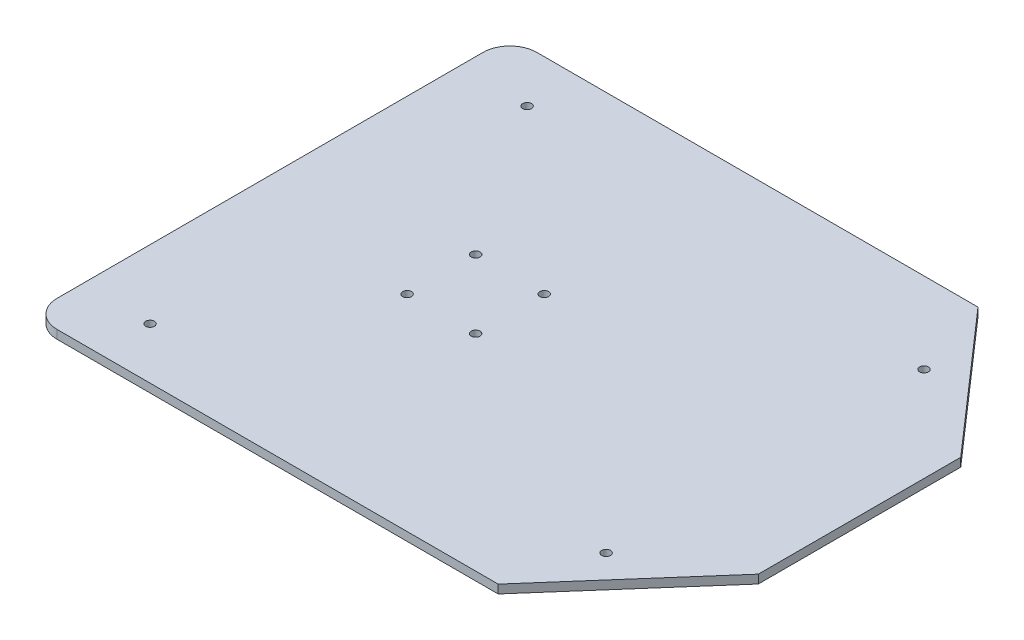
ISO-10303-21;
HEADER;
FILE_DESCRIPTION(('STEP AP214'),'2;1');
FILE_NAME('part.step','',(''),(''),'','','');
FILE_SCHEMA(('AUTOMOTIVE_DESIGN { 1 0 10303 214 1 1 1 1 }'));
ENDSEC;
DATA;
#1=APPLICATION_CONTEXT('core data for automotive mechanical design processes');
#2=APPLICATION_PROTOCOL_DEFINITION('international standard','automotive_design',2000,#1);
#3=PRODUCT_CONTEXT('',#1,'mechanical');
#4=PRODUCT('Part','Part','',(#3));
#5=PRODUCT_RELATED_PRODUCT_CATEGORY('part','',(#4));
#6=PRODUCT_DEFINITION_FORMATION('','',#4);
#7=PRODUCT_DEFINITION_CONTEXT('part definition',#1,'design');
#8=PRODUCT_DEFINITION('design','',#6,#7);
#9=PRODUCT_DEFINITION_SHAPE('','',#8);
#10=(LENGTH_UNIT() NAMED_UNIT(*) SI_UNIT(.MILLI.,.METRE.));
#11=(NAMED_UNIT(*) PLANE_ANGLE_UNIT() SI_UNIT($,.RADIAN.));
#12=(NAMED_UNIT(*) SI_UNIT($,.STERADIAN.) SOLID_ANGLE_UNIT());
#13=UNCERTAINTY_MEASURE_WITH_UNIT(LENGTH_MEASURE(1.E-05),#10,'distance_accuracy_value','');
#14=(GEOMETRIC_REPRESENTATION_CONTEXT(3) GLOBAL_UNCERTAINTY_ASSIGNED_CONTEXT((#13)) GLOBAL_UNIT_ASSIGNED_CONTEXT((#10,
#11,#12)) REPRESENTATION_CONTEXT('',''));
#15=CARTESIAN_POINT('',(0.,0.,0.));
#16=DIRECTION('',(0.,0.,1.));
#17=DIRECTION('',(1.,0.,0.));
#18=AXIS2_PLACEMENT_3D('',#15,#16,#17);
#19=CARTESIAN_POINT('',(-66.2,3.175,78.9));
#20=DIRECTION('',(0.,1.,0.));
#21=DIRECTION('',(0.,0.,1.));
#22=AXIS2_PLACEMENT_3D('',#19,#20,#21);
#23=PLANE('',#22);
#24=CARTESIAN_POINT('',(107.24,3.175,58.9));
#25=DIRECTION('',(0.,1.,0.));
#26=DIRECTION('',(0.,0.,1.));
#27=AXIS2_PLACEMENT_3D('',#24,#25,#26);
#28=CIRCLE('',#27,1.63194999999999);
#29=CARTESIAN_POINT('',(107.24,3.175,60.53195));
#30=VERTEX_POINT('',#29);
#31=EDGE_CURVE('E212',#30,#30,#28,.T.);
#32=ORIENTED_EDGE('',*,*,#31,.F.);
#33=EDGE_LOOP('',(#32));
#34=FACE_BOUND('',#33,.T.);
#35=CARTESIAN_POINT('',(-50.8,3.175,-69.85));
#36=DIRECTION('',(0.,1.,0.));
#37=DIRECTION('',(0.,0.,1.));
#38=AXIS2_PLACEMENT_3D('',#35,#36,#37);
#39=CIRCLE('',#38,1.63195);
#40=CARTESIAN_POINT('',(-50.8,3.175,-68.21805));
#41=VERTEX_POINT('',#40);
#42=EDGE_CURVE('E200',#41,#41,#39,.T.);
#43=ORIENTED_EDGE('',*,*,#42,.F.);
#44=EDGE_LOOP('',(#43));
#45=FACE_BOUND('',#44,.T.);
#46=CARTESIAN_POINT('',(12.7,3.175,12.7));
#47=DIRECTION('',(0.,1.,0.));
#48=DIRECTION('',(0.,0.,1.));
#49=AXIS2_PLACEMENT_3D('',#46,#47,#48);
#50=CIRCLE('',#49,1.63195);
#51=CARTESIAN_POINT('',(12.7,3.175,14.33195));
#52=VERTEX_POINT('',#51);
#53=EDGE_CURVE('E188',#52,#52,#50,.T.);
#54=ORIENTED_EDGE('',*,*,#53,.F.);
#55=EDGE_LOOP('',(#54));
#56=FACE_BOUND('',#55,.T.);
#57=CARTESIAN_POINT('',(-12.7,3.175,-12.7));
#58=DIRECTION('',(0.,1.,0.));
#59=DIRECTION('',(0.,0.,1.));
#60=AXIS2_PLACEMENT_3D('',#57,#58,#59);
#61=CIRCLE('',#60,1.63195);
#62=CARTESIAN_POINT('',(-12.7,3.175,-11.06805));
#63=VERTEX_POINT('',#62);
#64=EDGE_CURVE('E134',#63,#63,#61,.T.);
#65=ORIENTED_EDGE('',*,*,#64,.F.);
#66=EDGE_LOOP('',(#65));
#67=FACE_BOUND('',#66,.T.);
#68=CARTESIAN_POINT('',(-66.2,3.175,78.9));
#69=DIRECTION('',(0.,1.,0.));
#70=DIRECTION('',(0.,0.,1.));
#71=AXIS2_PLACEMENT_3D('',#68,#69,#70);
#72=CIRCLE('',#71,9.99999999999999);
#73=CARTESIAN_POINT('',(-76.2,3.175,78.8999999999999));
#74=VERTEX_POINT('',#73);
#75=CARTESIAN_POINT('',(-66.1999999999999,3.175,88.9));
#76=VERTEX_POINT('',#75);
#77=EDGE_CURVE('E145',#74,#76,#72,.T.);
#78=ORIENTED_EDGE('',*,*,#77,.T.);
#79=DIRECTION('',(1.,0.,0.));
#80=VECTOR('',#79,1.);
#81=CARTESIAN_POINT('',(-66.1999999999999,3.175,88.9));
#82=LINE('',#81,#80);
#83=CARTESIAN_POINT('',(97.24,3.175,88.9));
#84=VERTEX_POINT('',#83);
#85=EDGE_CURVE('E93',#76,#84,#82,.T.);
#86=ORIENTED_EDGE('',*,*,#85,.T.);
#87=DIRECTION('',(0.658711847193232,0.,-0.752395309905159));
#88=VECTOR('',#87,1.);
#89=CARTESIAN_POINT('',(142.24,3.175,37.5));
#90=LINE('',#89,#88);
#91=CARTESIAN_POINT('',(142.24,3.175,37.5));
#92=VERTEX_POINT('',#91);
#93=EDGE_CURVE('E160',#84,#92,#90,.T.);
#94=ORIENTED_EDGE('',*,*,#93,.T.);
#95=DIRECTION('',(0.,0.,-1.));
#96=VECTOR('',#95,1.);
#97=CARTESIAN_POINT('',(142.24,3.175,-37.5));
#98=LINE('',#97,#96);
#99=CARTESIAN_POINT('',(142.24,3.175,-37.5));
#100=VERTEX_POINT('',#99);
#101=EDGE_CURVE('E173',#92,#100,#98,.T.);
#102=ORIENTED_EDGE('',*,*,#101,.T.);
#103=DIRECTION('',(-0.658711847193232,0.,-0.752395309905159));
#104=VECTOR('',#103,1.);
#105=CARTESIAN_POINT('',(97.24,3.175,-88.9));
#106=LINE('',#105,#104);
#107=CARTESIAN_POINT('',(97.24,3.175,-88.9));
#108=VERTEX_POINT('',#107);
#109=EDGE_CURVE('E112',#100,#108,#106,.T.);
#110=ORIENTED_EDGE('',*,*,#109,.T.);
#111=DIRECTION('',(-1.,0.,0.));
#112=VECTOR('',#111,1.);
#113=CARTESIAN_POINT('',(-66.2,3.175,-88.9));
#114=LINE('',#113,#112);
#115=CARTESIAN_POINT('',(-66.2,3.175,-88.9));
#116=VERTEX_POINT('',#115);
#117=EDGE_CURVE('E106',#108,#116,#114,.T.);
#118=ORIENTED_EDGE('',*,*,#117,.T.);
#119=CARTESIAN_POINT('',(-66.2,3.175,-78.9));
#120=DIRECTION('',(0.,1.,0.));
#121=DIRECTION('',(0.,0.,1.));
#122=AXIS2_PLACEMENT_3D('',#119,#120,#121);
#123=CIRCLE('',#122,9.99999999999999);
#124=CARTESIAN_POINT('',(-76.2,3.175,-78.8999999999999));
#125=VERTEX_POINT('',#124);
#126=EDGE_CURVE('E110',#116,#125,#123,.T.);
#127=ORIENTED_EDGE('',*,*,#126,.T.);
#128=DIRECTION('',(0.,0.,1.));
#129=VECTOR('',#128,1.);
#130=CARTESIAN_POINT('',(-76.2,3.175,-78.8999999999999));
#131=LINE('',#130,#129);
#132=EDGE_CURVE('E50',#125,#74,#131,.T.);
#133=ORIENTED_EDGE('',*,*,#132,.T.);
#134=EDGE_LOOP('',(#78,#86,#94,#102,#110,#118,#127,#133));
#135=FACE_BOUND('',#134,.T.);
#136=CARTESIAN_POINT('',(12.7,3.175,-12.7));
#137=DIRECTION('',(0.,1.,0.));
#138=DIRECTION('',(0.,0.,1.));
#139=AXIS2_PLACEMENT_3D('',#136,#137,#138);
#140=CIRCLE('',#139,1.63195);
#141=CARTESIAN_POINT('',(12.7,3.175,-11.06805));
#142=VERTEX_POINT('',#141);
#143=EDGE_CURVE('E182',#142,#142,#140,.T.);
#144=ORIENTED_EDGE('',*,*,#143,.F.);
#145=EDGE_LOOP('',(#144));
#146=FACE_BOUND('',#145,.T.);
#147=CARTESIAN_POINT('',(-12.7,3.175,12.7));
#148=DIRECTION('',(0.,1.,0.));
#149=DIRECTION('',(0.,0.,1.));
#150=AXIS2_PLACEMENT_3D('',#147,#148,#149);
#151=CIRCLE('',#150,1.63195);
#152=CARTESIAN_POINT('',(-12.7,3.175,14.33195));
#153=VERTEX_POINT('',#152);
#154=EDGE_CURVE('E194',#153,#153,#151,.T.);
#155=ORIENTED_EDGE('',*,*,#154,.F.);
#156=EDGE_LOOP('',(#155));
#157=FACE_BOUND('',#156,.T.);
#158=CARTESIAN_POINT('',(107.24,3.175,-58.9));
#159=DIRECTION('',(0.,1.,0.));
#160=DIRECTION('',(0.,0.,1.));
#161=AXIS2_PLACEMENT_3D('',#158,#159,#160);
#162=CIRCLE('',#161,1.63194999999999);
#163=CARTESIAN_POINT('',(107.24,3.175,-57.26805));
#164=VERTEX_POINT('',#163);
#165=EDGE_CURVE('E206',#164,#164,#162,.T.);
#166=ORIENTED_EDGE('',*,*,#165,.F.);
#167=EDGE_LOOP('',(#166));
#168=FACE_BOUND('',#167,.T.);
#169=CARTESIAN_POINT('',(-50.8,3.175,69.85));
#170=DIRECTION('',(0.,1.,0.));
#171=DIRECTION('',(0.,0.,1.));
#172=AXIS2_PLACEMENT_3D('',#169,#170,#171);
#173=CIRCLE('',#172,1.63195);
#174=CARTESIAN_POINT('',(-50.8,3.175,71.48195));
#175=VERTEX_POINT('',#174);
#176=EDGE_CURVE('E218',#175,#175,#173,.T.);
#177=ORIENTED_EDGE('',*,*,#176,.F.);
#178=EDGE_LOOP('',(#177));
#179=FACE_BOUND('',#178,.T.);
#180=ADVANCED_FACE('F33',(#34,#45,#56,#67,#135,#146,#157,#168,#179),#23,.T.);
#181=CARTESIAN_POINT('',(-66.2,0.,78.9));
#182=DIRECTION('',(0.,1.,0.));
#183=DIRECTION('',(0.,0.,1.));
#184=AXIS2_PLACEMENT_3D('',#181,#182,#183);
#185=PLANE('',#184);
#186=CARTESIAN_POINT('',(-66.2,0.,78.9));
#187=DIRECTION('',(0.,1.,0.));
#188=DIRECTION('',(0.,0.,1.));
#189=AXIS2_PLACEMENT_3D('',#186,#187,#188);
#190=CIRCLE('',#189,9.99999999999999);
#191=CARTESIAN_POINT('',(-76.2,0.,78.8999999999999));
#192=VERTEX_POINT('',#191);
#193=CARTESIAN_POINT('',(-66.1999999999999,0.,88.9));
#194=VERTEX_POINT('',#193);
#195=EDGE_CURVE('E130',#192,#194,#190,.T.);
#196=ORIENTED_EDGE('',*,*,#195,.F.);
#197=DIRECTION('',(0.,0.,1.));
#198=VECTOR('',#197,1.);
#199=CARTESIAN_POINT('',(-76.2,0.,-78.8999999999999));
#200=LINE('',#199,#198);
#201=CARTESIAN_POINT('',(-76.2,0.,-78.8999999999999));
#202=VERTEX_POINT('',#201);
#203=EDGE_CURVE('E85',#202,#192,#200,.T.);
#204=ORIENTED_EDGE('',*,*,#203,.F.);
#205=CARTESIAN_POINT('',(-66.2,0.,-78.9));
#206=DIRECTION('',(0.,1.,0.));
#207=DIRECTION('',(0.,0.,1.));
#208=AXIS2_PLACEMENT_3D('',#205,#206,#207);
#209=CIRCLE('',#208,9.99999999999999);
#210=CARTESIAN_POINT('',(-66.2,0.,-88.9));
#211=VERTEX_POINT('',#210);
#212=EDGE_CURVE('E79',#211,#202,#209,.T.);
#213=ORIENTED_EDGE('',*,*,#212,.F.);
#214=DIRECTION('',(-1.,0.,0.));
#215=VECTOR('',#214,1.);
#216=CARTESIAN_POINT('',(-66.2,0.,-88.9));
#217=LINE('',#216,#215);
#218=CARTESIAN_POINT('',(97.24,0.,-88.9));
#219=VERTEX_POINT('',#218);
#220=EDGE_CURVE('E120',#219,#211,#217,.T.);
#221=ORIENTED_EDGE('',*,*,#220,.F.);
#222=DIRECTION('',(-0.658711847193232,0.,-0.752395309905159));
#223=VECTOR('',#222,1.);
#224=CARTESIAN_POINT('',(97.24,0.,-88.9));
#225=LINE('',#224,#223);
#226=CARTESIAN_POINT('',(142.24,0.,-37.5));
#227=VERTEX_POINT('',#226);
#228=EDGE_CURVE('E140',#227,#219,#225,.T.);
#229=ORIENTED_EDGE('',*,*,#228,.F.);
#230=DIRECTION('',(0.,0.,-1.));
#231=VECTOR('',#230,1.);
#232=CARTESIAN_POINT('',(142.24,0.,-37.5));
#233=LINE('',#232,#231);
#234=CARTESIAN_POINT('',(142.24,0.,37.5));
#235=VERTEX_POINT('',#234);
#236=EDGE_CURVE('E138',#235,#227,#233,.T.);
#237=ORIENTED_EDGE('',*,*,#236,.F.);
#238=DIRECTION('',(0.658711847193232,0.,-0.752395309905159));
#239=VECTOR('',#238,1.);
#240=CARTESIAN_POINT('',(142.24,0.,37.5));
#241=LINE('',#240,#239);
#242=CARTESIAN_POINT('',(97.24,0.,88.9));
#243=VERTEX_POINT('',#242);
#244=EDGE_CURVE('E136',#243,#235,#241,.T.);
#245=ORIENTED_EDGE('',*,*,#244,.F.);
#246=DIRECTION('',(1.,0.,0.));
#247=VECTOR('',#246,1.);
#248=CARTESIAN_POINT('',(-66.1999999999999,0.,88.9));
#249=LINE('',#248,#247);
#250=EDGE_CURVE('E133',#194,#243,#249,.T.);
#251=ORIENTED_EDGE('',*,*,#250,.F.);
#252=EDGE_LOOP('',(#196,#204,#213,#221,#229,#237,#245,#251));
#253=FACE_BOUND('',#252,.T.);
#254=CARTESIAN_POINT('',(-12.7,0.,-12.7));
#255=DIRECTION('',(0.,1.,0.));
#256=DIRECTION('',(0.,0.,1.));
#257=AXIS2_PLACEMENT_3D('',#254,#255,#256);
#258=CIRCLE('',#257,1.63195);
#259=CARTESIAN_POINT('',(-12.7,0.,-11.06805));
#260=VERTEX_POINT('',#259);
#261=EDGE_CURVE('E179',#260,#260,#258,.T.);
#262=ORIENTED_EDGE('',*,*,#261,.T.);
#263=EDGE_LOOP('',(#262));
#264=FACE_BOUND('',#263,.T.);
#265=CARTESIAN_POINT('',(12.7,0.,-12.7));
#266=DIRECTION('',(0.,1.,0.));
#267=DIRECTION('',(0.,0.,1.));
#268=AXIS2_PLACEMENT_3D('',#265,#266,#267);
#269=CIRCLE('',#268,1.63195);
#270=CARTESIAN_POINT('',(12.7,0.,-11.06805));
#271=VERTEX_POINT('',#270);
#272=EDGE_CURVE('E185',#271,#271,#269,.T.);
#273=ORIENTED_EDGE('',*,*,#272,.T.);
#274=EDGE_LOOP('',(#273));
#275=FACE_BOUND('',#274,.T.);
#276=CARTESIAN_POINT('',(12.7,0.,12.7));
#277=DIRECTION('',(0.,1.,0.));
#278=DIRECTION('',(0.,0.,1.));
#279=AXIS2_PLACEMENT_3D('',#276,#277,#278);
#280=CIRCLE('',#279,1.63195);
#281=CARTESIAN_POINT('',(12.7,0.,14.33195));
#282=VERTEX_POINT('',#281);
#283=EDGE_CURVE('E191',#282,#282,#280,.T.);
#284=ORIENTED_EDGE('',*,*,#283,.T.);
#285=EDGE_LOOP('',(#284));
#286=FACE_BOUND('',#285,.T.);
#287=CARTESIAN_POINT('',(-12.7,0.,12.7));
#288=DIRECTION('',(0.,1.,0.));
#289=DIRECTION('',(0.,0.,1.));
#290=AXIS2_PLACEMENT_3D('',#287,#288,#289);
#291=CIRCLE('',#290,1.63195);
#292=CARTESIAN_POINT('',(-12.7,0.,14.33195));
#293=VERTEX_POINT('',#292);
#294=EDGE_CURVE('E197',#293,#293,#291,.T.);
#295=ORIENTED_EDGE('',*,*,#294,.T.);
#296=EDGE_LOOP('',(#295));
#297=FACE_BOUND('',#296,.T.);
#298=CARTESIAN_POINT('',(-50.8,0.,-69.85));
#299=DIRECTION('',(0.,1.,0.));
#300=DIRECTION('',(0.,0.,1.));
#301=AXIS2_PLACEMENT_3D('',#298,#299,#300);
#302=CIRCLE('',#301,1.63195);
#303=CARTESIAN_POINT('',(-50.8,0.,-68.21805));
#304=VERTEX_POINT('',#303);
#305=EDGE_CURVE('E203',#304,#304,#302,.T.);
#306=ORIENTED_EDGE('',*,*,#305,.T.);
#307=EDGE_LOOP('',(#306));
#308=FACE_BOUND('',#307,.T.);
#309=CARTESIAN_POINT('',(107.24,0.,-58.9));
#310=DIRECTION('',(0.,1.,0.));
#311=DIRECTION('',(0.,0.,1.));
#312=AXIS2_PLACEMENT_3D('',#309,#310,#311);
#313=CIRCLE('',#312,1.63194999999999);
#314=CARTESIAN_POINT('',(107.24,0.,-57.26805));
#315=VERTEX_POINT('',#314);
#316=EDGE_CURVE('E209',#315,#315,#313,.T.);
#317=ORIENTED_EDGE('',*,*,#316,.T.);
#318=EDGE_LOOP('',(#317));
#319=FACE_BOUND('',#318,.T.);
#320=CARTESIAN_POINT('',(107.24,0.,58.9));
#321=DIRECTION('',(0.,1.,0.));
#322=DIRECTION('',(0.,0.,1.));
#323=AXIS2_PLACEMENT_3D('',#320,#321,#322);
#324=CIRCLE('',#323,1.63194999999999);
#325=CARTESIAN_POINT('',(107.24,0.,60.53195));
#326=VERTEX_POINT('',#325);
#327=EDGE_CURVE('E215',#326,#326,#324,.T.);
#328=ORIENTED_EDGE('',*,*,#327,.T.);
#329=EDGE_LOOP('',(#328));
#330=FACE_BOUND('',#329,.T.);
#331=CARTESIAN_POINT('',(-50.8,0.,69.85));
#332=DIRECTION('',(0.,1.,0.));
#333=DIRECTION('',(0.,0.,1.));
#334=AXIS2_PLACEMENT_3D('',#331,#332,#333);
#335=CIRCLE('',#334,1.63195);
#336=CARTESIAN_POINT('',(-50.8,0.,71.48195));
#337=VERTEX_POINT('',#336);
#338=EDGE_CURVE('E221',#337,#337,#335,.T.);
#339=ORIENTED_EDGE('',*,*,#338,.T.);
#340=EDGE_LOOP('',(#339));
#341=FACE_BOUND('',#340,.T.);
#342=ADVANCED_FACE('F164',(#253,#264,#275,#286,#297,#308,#319,#330,#341),#185,.F.);
#343=CARTESIAN_POINT('',(-66.2,3.175,78.9));
#344=DIRECTION('',(0.,-1.,0.));
#345=DIRECTION('',(0.,0.,-1.));
#346=AXIS2_PLACEMENT_3D('',#343,#344,#345);
#347=CYLINDRICAL_SURFACE('',#346,9.99999999999999);
#348=ORIENTED_EDGE('',*,*,#195,.T.);
#349=DIRECTION('',(0.,-1.,0.));
#350=VECTOR('',#349,1.);
#351=CARTESIAN_POINT('',(-66.1999999999999,3.175,88.9));
#352=LINE('',#351,#350);
#353=EDGE_CURVE('E11',#76,#194,#352,.T.);
#354=ORIENTED_EDGE('',*,*,#353,.F.);
#355=ORIENTED_EDGE('',*,*,#77,.F.);
#356=DIRECTION('',(0.,-1.,0.));
#357=VECTOR('',#356,1.);
#358=CARTESIAN_POINT('',(-76.2,3.175,78.8999999999999));
#359=LINE('',#358,#357);
#360=EDGE_CURVE('E126',#74,#192,#359,.T.);
#361=ORIENTED_EDGE('',*,*,#360,.T.);
#362=EDGE_LOOP('',(#348,#354,#355,#361));
#363=FACE_BOUND('',#362,.T.);
#364=ADVANCED_FACE('F35',(#363),#347,.T.);
#365=CARTESIAN_POINT('',(-66.1999999999999,3.175,88.9));
#366=DIRECTION('',(0.,0.,-1.));
#367=DIRECTION('',(-1.,0.,0.));
#368=AXIS2_PLACEMENT_3D('',#365,#366,#367);
#369=PLANE('',#368);
#370=ORIENTED_EDGE('',*,*,#250,.T.);
#371=DIRECTION('',(0.,-1.,0.));
#372=VECTOR('',#371,1.);
#373=CARTESIAN_POINT('',(97.24,3.175,88.9));
#374=LINE('',#373,#372);
#375=EDGE_CURVE('E42',#84,#243,#374,.T.);
#376=ORIENTED_EDGE('',*,*,#375,.F.);
#377=ORIENTED_EDGE('',*,*,#85,.F.);
#378=ORIENTED_EDGE('',*,*,#353,.T.);
#379=EDGE_LOOP('',(#370,#376,#377,#378));
#380=FACE_BOUND('',#379,.T.);
#381=ADVANCED_FACE('F255',(#380),#369,.F.);
#382=CARTESIAN_POINT('',(142.24,3.175,37.5));
#383=DIRECTION('',(-0.752395309905159,0.,-0.658711847193232));
#384=DIRECTION('',(-0.658711847193232,0.,0.752395309905159));
#385=AXIS2_PLACEMENT_3D('',#382,#383,#384);
#386=PLANE('',#385);
#387=ORIENTED_EDGE('',*,*,#244,.T.);
#388=DIRECTION('',(0.,-1.,0.));
#389=VECTOR('',#388,1.);
#390=CARTESIAN_POINT('',(142.24,3.175,37.5));
#391=LINE('',#390,#389);
#392=EDGE_CURVE('E152',#92,#235,#391,.T.);
#393=ORIENTED_EDGE('',*,*,#392,.F.);
#394=ORIENTED_EDGE('',*,*,#93,.F.);
#395=ORIENTED_EDGE('',*,*,#375,.T.);
#396=EDGE_LOOP('',(#387,#393,#394,#395));
#397=FACE_BOUND('',#396,.T.);
#398=ADVANCED_FACE('F158',(#397),#386,.F.);
#399=CARTESIAN_POINT('',(142.24,3.175,-37.5));
#400=DIRECTION('',(-1.,0.,0.));
#401=DIRECTION('',(0.,0.,1.));
#402=AXIS2_PLACEMENT_3D('',#399,#400,#401);
#403=PLANE('',#402);
#404=ORIENTED_EDGE('',*,*,#236,.T.);
#405=DIRECTION('',(0.,-1.,0.));
#406=VECTOR('',#405,1.);
#407=CARTESIAN_POINT('',(142.24,3.175,-37.5));
#408=LINE('',#407,#406);
#409=EDGE_CURVE('E149',#100,#227,#408,.T.);
#410=ORIENTED_EDGE('',*,*,#409,.F.);
#411=ORIENTED_EDGE('',*,*,#101,.F.);
#412=ORIENTED_EDGE('',*,*,#392,.T.);
#413=EDGE_LOOP('',(#404,#410,#411,#412));
#414=FACE_BOUND('',#413,.T.);
#415=ADVANCED_FACE('F169',(#414),#403,.F.);
#416=CARTESIAN_POINT('',(97.24,3.175,-88.9));
#417=DIRECTION('',(-0.752395309905159,0.,0.658711847193232));
#418=DIRECTION('',(0.658711847193232,0.,0.752395309905159));
#419=AXIS2_PLACEMENT_3D('',#416,#417,#418);
#420=PLANE('',#419);
#421=ORIENTED_EDGE('',*,*,#228,.T.);
#422=DIRECTION('',(0.,-1.,0.));
#423=VECTOR('',#422,1.);
#424=CARTESIAN_POINT('',(97.24,3.175,-88.9));
#425=LINE('',#424,#423);
#426=EDGE_CURVE('E121',#108,#219,#425,.T.);
#427=ORIENTED_EDGE('',*,*,#426,.F.);
#428=ORIENTED_EDGE('',*,*,#109,.F.);
#429=ORIENTED_EDGE('',*,*,#409,.T.);
#430=EDGE_LOOP('',(#421,#427,#428,#429));
#431=FACE_BOUND('',#430,.T.);
#432=ADVANCED_FACE('F172',(#431),#420,.F.);
#433=CARTESIAN_POINT('',(-66.2,3.175,-88.9));
#434=DIRECTION('',(0.,0.,1.));
#435=DIRECTION('',(1.,0.,0.));
#436=AXIS2_PLACEMENT_3D('',#433,#434,#435);
#437=PLANE('',#436);
#438=ORIENTED_EDGE('',*,*,#220,.T.);
#439=DIRECTION('',(0.,-1.,0.));
#440=VECTOR('',#439,1.);
#441=CARTESIAN_POINT('',(-66.2,3.175,-88.9));
#442=LINE('',#441,#440);
#443=EDGE_CURVE('E117',#116,#211,#442,.T.);
#444=ORIENTED_EDGE('',*,*,#443,.F.);
#445=ORIENTED_EDGE('',*,*,#117,.F.);
#446=ORIENTED_EDGE('',*,*,#426,.T.);
#447=EDGE_LOOP('',(#438,#444,#445,#446));
#448=FACE_BOUND('',#447,.T.);
#449=ADVANCED_FACE('F118',(#448),#437,.F.);
#450=CARTESIAN_POINT('',(-66.2,3.175,-78.9));
#451=DIRECTION('',(0.,-1.,0.));
#452=DIRECTION('',(0.,0.,-1.));
#453=AXIS2_PLACEMENT_3D('',#450,#451,#452);
#454=CYLINDRICAL_SURFACE('',#453,9.99999999999999);
#455=ORIENTED_EDGE('',*,*,#212,.T.);
#456=DIRECTION('',(0.,-1.,0.));
#457=VECTOR('',#456,1.);
#458=CARTESIAN_POINT('',(-76.2,3.175,-78.8999999999999));
#459=LINE('',#458,#457);
#460=EDGE_CURVE('E122',#125,#202,#459,.T.);
#461=ORIENTED_EDGE('',*,*,#460,.F.);
#462=ORIENTED_EDGE('',*,*,#126,.F.);
#463=ORIENTED_EDGE('',*,*,#443,.T.);
#464=EDGE_LOOP('',(#455,#461,#462,#463));
#465=FACE_BOUND('',#464,.T.);
#466=ADVANCED_FACE('F124',(#465),#454,.T.);
#467=CARTESIAN_POINT('',(-76.2,3.175,-78.8999999999999));
#468=DIRECTION('',(1.,0.,0.));
#469=DIRECTION('',(0.,0.,-1.));
#470=AXIS2_PLACEMENT_3D('',#467,#468,#469);
#471=PLANE('',#470);
#472=ORIENTED_EDGE('',*,*,#203,.T.);
#473=ORIENTED_EDGE('',*,*,#360,.F.);
#474=ORIENTED_EDGE('',*,*,#132,.F.);
#475=ORIENTED_EDGE('',*,*,#460,.T.);
#476=EDGE_LOOP('',(#472,#473,#474,#475));
#477=FACE_BOUND('',#476,.T.);
#478=ADVANCED_FACE('F243',(#477),#471,.F.);
#479=CARTESIAN_POINT('',(-12.7,3.175,-12.7));
#480=DIRECTION('',(0.,-1.,0.));
#481=DIRECTION('',(0.,0.,-1.));
#482=AXIS2_PLACEMENT_3D('',#479,#480,#481);
#483=CYLINDRICAL_SURFACE('',#482,1.63195);
#484=ORIENTED_EDGE('',*,*,#64,.T.);
#485=EDGE_LOOP('',(#484));
#486=FACE_BOUND('',#485,.T.);
#487=ORIENTED_EDGE('',*,*,#261,.F.);
#488=EDGE_LOOP('',(#487));
#489=FACE_BOUND('',#488,.T.);
#490=ADVANCED_FACE('F240',(#486,#489),#483,.F.);
#491=CARTESIAN_POINT('',(12.7,3.175,-12.7));
#492=DIRECTION('',(0.,-1.,0.));
#493=DIRECTION('',(0.,0.,-1.));
#494=AXIS2_PLACEMENT_3D('',#491,#492,#493);
#495=CYLINDRICAL_SURFACE('',#494,1.63195);
#496=ORIENTED_EDGE('',*,*,#143,.T.);
#497=EDGE_LOOP('',(#496));
#498=FACE_BOUND('',#497,.T.);
#499=ORIENTED_EDGE('',*,*,#272,.F.);
#500=EDGE_LOOP('',(#499));
#501=FACE_BOUND('',#500,.T.);
#502=ADVANCED_FACE('F319',(#498,#501),#495,.F.);
#503=CARTESIAN_POINT('',(12.7,3.175,12.7));
#504=DIRECTION('',(0.,-1.,0.));
#505=DIRECTION('',(0.,0.,-1.));
#506=AXIS2_PLACEMENT_3D('',#503,#504,#505);
#507=CYLINDRICAL_SURFACE('',#506,1.63195);
#508=ORIENTED_EDGE('',*,*,#53,.T.);
#509=EDGE_LOOP('',(#508));
#510=FACE_BOUND('',#509,.T.);
#511=ORIENTED_EDGE('',*,*,#283,.F.);
#512=EDGE_LOOP('',(#511));
#513=FACE_BOUND('',#512,.T.);
#514=ADVANCED_FACE('F327',(#510,#513),#507,.F.);
#515=CARTESIAN_POINT('',(-12.7,3.175,12.7));
#516=DIRECTION('',(0.,-1.,0.));
#517=DIRECTION('',(0.,0.,-1.));
#518=AXIS2_PLACEMENT_3D('',#515,#516,#517);
#519=CYLINDRICAL_SURFACE('',#518,1.63195);
#520=ORIENTED_EDGE('',*,*,#154,.T.);
#521=EDGE_LOOP('',(#520));
#522=FACE_BOUND('',#521,.T.);
#523=ORIENTED_EDGE('',*,*,#294,.F.);
#524=EDGE_LOOP('',(#523));
#525=FACE_BOUND('',#524,.T.);
#526=ADVANCED_FACE('F335',(#522,#525),#519,.F.);
#527=CARTESIAN_POINT('',(-50.8,3.175,-69.85));
#528=DIRECTION('',(0.,-1.,0.));
#529=DIRECTION('',(0.,0.,-1.));
#530=AXIS2_PLACEMENT_3D('',#527,#528,#529);
#531=CYLINDRICAL_SURFACE('',#530,1.63195);
#532=ORIENTED_EDGE('',*,*,#42,.T.);
#533=EDGE_LOOP('',(#532));
#534=FACE_BOUND('',#533,.T.);
#535=ORIENTED_EDGE('',*,*,#305,.F.);
#536=EDGE_LOOP('',(#535));
#537=FACE_BOUND('',#536,.T.);
#538=ADVANCED_FACE('F344',(#534,#537),#531,.F.);
#539=CARTESIAN_POINT('',(107.24,3.175,-58.9));
#540=DIRECTION('',(0.,-1.,0.));
#541=DIRECTION('',(0.,0.,-1.));
#542=AXIS2_PLACEMENT_3D('',#539,#540,#541);
#543=CYLINDRICAL_SURFACE('',#542,1.63194999999999);
#544=ORIENTED_EDGE('',*,*,#165,.T.);
#545=EDGE_LOOP('',(#544));
#546=FACE_BOUND('',#545,.T.);
#547=ORIENTED_EDGE('',*,*,#316,.F.);
#548=EDGE_LOOP('',(#547));
#549=FACE_BOUND('',#548,.T.);
#550=ADVANCED_FACE('F353',(#546,#549),#543,.F.);
#551=CARTESIAN_POINT('',(107.24,3.175,58.9));
#552=DIRECTION('',(0.,-1.,0.));
#553=DIRECTION('',(0.,0.,-1.));
#554=AXIS2_PLACEMENT_3D('',#551,#552,#553);
#555=CYLINDRICAL_SURFACE('',#554,1.63194999999999);
#556=ORIENTED_EDGE('',*,*,#31,.T.);
#557=EDGE_LOOP('',(#556));
#558=FACE_BOUND('',#557,.T.);
#559=ORIENTED_EDGE('',*,*,#327,.F.);
#560=EDGE_LOOP('',(#559));
#561=FACE_BOUND('',#560,.T.);
#562=ADVANCED_FACE('F362',(#558,#561),#555,.F.);
#563=CARTESIAN_POINT('',(-50.8,3.175,69.85));
#564=DIRECTION('',(0.,-1.,0.));
#565=DIRECTION('',(0.,0.,-1.));
#566=AXIS2_PLACEMENT_3D('',#563,#564,#565);
#567=CYLINDRICAL_SURFACE('',#566,1.63195);
#568=ORIENTED_EDGE('',*,*,#176,.T.);
#569=EDGE_LOOP('',(#568));
#570=FACE_BOUND('',#569,.T.);
#571=ORIENTED_EDGE('',*,*,#338,.F.);
#572=EDGE_LOOP('',(#571));
#573=FACE_BOUND('',#572,.T.);
#574=ADVANCED_FACE('F227',(#570,#573),#567,.F.);
#575=CLOSED_SHELL('',(#180,#342,#364,#381,#398,#415,#432,#449,#466,#478,#490,#502,#514,#526,
#538,#550,#562,#574));
#576=MANIFOLD_SOLID_BREP('B2',#575);
#577=ADVANCED_BREP_SHAPE_REPRESENTATION('',(#18,#576),#14);
#578=SHAPE_DEFINITION_REPRESENTATION(#9,#577);
ENDSEC;
END-ISO-10303-21;
